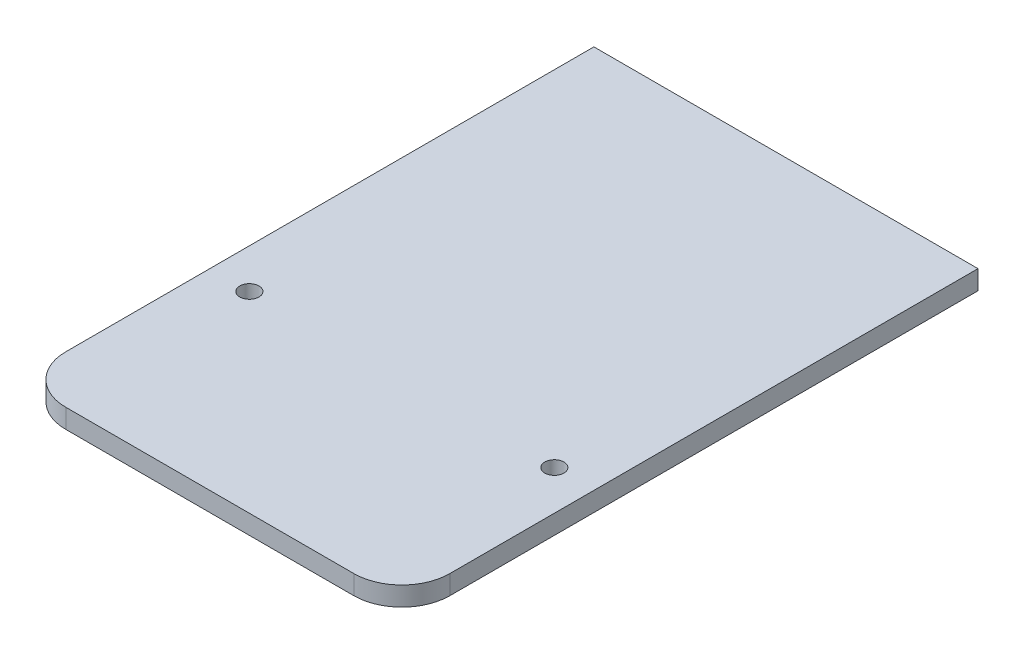
ISO-10303-21;
HEADER;
FILE_DESCRIPTION(('STEP AP214'),'2;1');
FILE_NAME('part.step','',(''),(''),'','','');
FILE_SCHEMA(('AUTOMOTIVE_DESIGN { 1 0 10303 214 1 1 1 1 }'));
ENDSEC;
DATA;
#1=APPLICATION_CONTEXT('core data for automotive mechanical design processes');
#2=APPLICATION_PROTOCOL_DEFINITION('international standard','automotive_design',2000,#1);
#3=PRODUCT_CONTEXT('',#1,'mechanical');
#4=PRODUCT('Part','Part','',(#3));
#5=PRODUCT_RELATED_PRODUCT_CATEGORY('part','',(#4));
#6=PRODUCT_DEFINITION_FORMATION('','',#4);
#7=PRODUCT_DEFINITION_CONTEXT('part definition',#1,'design');
#8=PRODUCT_DEFINITION('design','',#6,#7);
#9=PRODUCT_DEFINITION_SHAPE('','',#8);
#10=(LENGTH_UNIT() NAMED_UNIT(*) SI_UNIT(.MILLI.,.METRE.));
#11=(NAMED_UNIT(*) PLANE_ANGLE_UNIT() SI_UNIT($,.RADIAN.));
#12=(NAMED_UNIT(*) SI_UNIT($,.STERADIAN.) SOLID_ANGLE_UNIT());
#13=UNCERTAINTY_MEASURE_WITH_UNIT(LENGTH_MEASURE(1.E-05),#10,'distance_accuracy_value','');
#14=(GEOMETRIC_REPRESENTATION_CONTEXT(3) GLOBAL_UNCERTAINTY_ASSIGNED_CONTEXT((#13)) GLOBAL_UNIT_ASSIGNED_CONTEXT((#10,
#11,#12)) REPRESENTATION_CONTEXT('',''));
#15=CARTESIAN_POINT('',(0.,0.,0.));
#16=DIRECTION('',(0.,0.,1.));
#17=DIRECTION('',(1.,0.,0.));
#18=AXIS2_PLACEMENT_3D('',#15,#16,#17);
#19=CARTESIAN_POINT('',(-100.,-10.,-150.));
#20=DIRECTION('',(-1.,0.,0.));
#21=DIRECTION('',(0.,0.,1.));
#22=AXIS2_PLACEMENT_3D('',#19,#20,#21);
#23=PLANE('',#22);
#24=DIRECTION('',(0.,0.,1.));
#25=VECTOR('',#24,1.);
#26=CARTESIAN_POINT('',(-100.,0.,-150.));
#27=LINE('',#26,#25);
#28=CARTESIAN_POINT('',(-100.,0.,-150.));
#29=VERTEX_POINT('',#28);
#30=CARTESIAN_POINT('',(-100.,0.,125.));
#31=VERTEX_POINT('',#30);
#32=EDGE_CURVE('E136',#29,#31,#27,.T.);
#33=ORIENTED_EDGE('',*,*,#32,.F.);
#34=DIRECTION('',(0.,1.,0.));
#35=VECTOR('',#34,1.);
#36=CARTESIAN_POINT('',(-100.,-10.,-150.));
#37=LINE('',#36,#35);
#38=CARTESIAN_POINT('',(-100.,-10.,-150.));
#39=VERTEX_POINT('',#38);
#40=EDGE_CURVE('E11',#39,#29,#37,.T.);
#41=ORIENTED_EDGE('',*,*,#40,.F.);
#42=DIRECTION('',(0.,0.,1.));
#43=VECTOR('',#42,1.);
#44=CARTESIAN_POINT('',(-100.,-10.,-150.));
#45=LINE('',#44,#43);
#46=CARTESIAN_POINT('',(-100.,-10.,125.));
#47=VERTEX_POINT('',#46);
#48=EDGE_CURVE('E157',#39,#47,#45,.T.);
#49=ORIENTED_EDGE('',*,*,#48,.T.);
#50=DIRECTION('',(0.,1.,0.));
#51=VECTOR('',#50,1.);
#52=CARTESIAN_POINT('',(-100.,-10.,125.));
#53=LINE('',#52,#51);
#54=EDGE_CURVE('E48',#47,#31,#53,.T.);
#55=ORIENTED_EDGE('',*,*,#54,.T.);
#56=EDGE_LOOP('',(#33,#41,#49,#55));
#57=FACE_BOUND('',#56,.T.);
#58=ADVANCED_FACE('F45',(#57),#23,.T.);
#59=CARTESIAN_POINT('',(-100.,-10.,-150.));
#60=DIRECTION('',(0.,0.,-1.));
#61=DIRECTION('',(-1.,0.,0.));
#62=AXIS2_PLACEMENT_3D('',#59,#60,#61);
#63=PLANE('',#62);
#64=DIRECTION('',(-1.,0.,0.));
#65=VECTOR('',#64,1.);
#66=CARTESIAN_POINT('',(-100.,0.,-150.));
#67=LINE('',#66,#65);
#68=CARTESIAN_POINT('',(100.,0.,-150.));
#69=VERTEX_POINT('',#68);
#70=EDGE_CURVE('E154',#69,#29,#67,.T.);
#71=ORIENTED_EDGE('',*,*,#70,.F.);
#72=DIRECTION('',(0.,1.,0.));
#73=VECTOR('',#72,1.);
#74=CARTESIAN_POINT('',(100.,-10.,-150.));
#75=LINE('',#74,#73);
#76=CARTESIAN_POINT('',(100.,-10.,-150.));
#77=VERTEX_POINT('',#76);
#78=EDGE_CURVE('E55',#77,#69,#75,.T.);
#79=ORIENTED_EDGE('',*,*,#78,.F.);
#80=DIRECTION('',(-1.,0.,0.));
#81=VECTOR('',#80,1.);
#82=CARTESIAN_POINT('',(-100.,-10.,-150.));
#83=LINE('',#82,#81);
#84=EDGE_CURVE('E122',#77,#39,#83,.T.);
#85=ORIENTED_EDGE('',*,*,#84,.T.);
#86=ORIENTED_EDGE('',*,*,#40,.T.);
#87=EDGE_LOOP('',(#71,#79,#85,#86));
#88=FACE_BOUND('',#87,.T.);
#89=ADVANCED_FACE('F169',(#88),#63,.T.);
#90=CARTESIAN_POINT('',(100.,-10.,-150.));
#91=DIRECTION('',(1.,0.,0.));
#92=DIRECTION('',(0.,0.,-1.));
#93=AXIS2_PLACEMENT_3D('',#90,#91,#92);
#94=PLANE('',#93);
#95=DIRECTION('',(0.,0.,-1.));
#96=VECTOR('',#95,1.);
#97=CARTESIAN_POINT('',(100.,0.,-150.));
#98=LINE('',#97,#96);
#99=CARTESIAN_POINT('',(100.,0.,125.));
#100=VERTEX_POINT('',#99);
#101=EDGE_CURVE('E108',#100,#69,#98,.T.);
#102=ORIENTED_EDGE('',*,*,#101,.F.);
#103=DIRECTION('',(0.,1.,0.));
#104=VECTOR('',#103,1.);
#105=CARTESIAN_POINT('',(100.,-10.,125.));
#106=LINE('',#105,#104);
#107=CARTESIAN_POINT('',(100.,-10.,125.));
#108=VERTEX_POINT('',#107);
#109=EDGE_CURVE('E103',#108,#100,#106,.T.);
#110=ORIENTED_EDGE('',*,*,#109,.F.);
#111=DIRECTION('',(0.,0.,-1.));
#112=VECTOR('',#111,1.);
#113=CARTESIAN_POINT('',(100.,-10.,-150.));
#114=LINE('',#113,#112);
#115=EDGE_CURVE('E106',#108,#77,#114,.T.);
#116=ORIENTED_EDGE('',*,*,#115,.T.);
#117=ORIENTED_EDGE('',*,*,#78,.T.);
#118=EDGE_LOOP('',(#102,#110,#116,#117));
#119=FACE_BOUND('',#118,.T.);
#120=ADVANCED_FACE('F105',(#119),#94,.T.);
#121=CARTESIAN_POINT('',(75.,-10.,125.));
#122=DIRECTION('',(0.,1.,0.));
#123=DIRECTION('',(0.,0.,1.));
#124=AXIS2_PLACEMENT_3D('',#121,#122,#123);
#125=CYLINDRICAL_SURFACE('',#124,25.);
#126=CARTESIAN_POINT('',(75.,0.,125.));
#127=DIRECTION('',(0.,1.,0.));
#128=DIRECTION('',(0.,0.,1.));
#129=AXIS2_PLACEMENT_3D('',#126,#127,#128);
#130=CIRCLE('',#129,25.);
#131=CARTESIAN_POINT('',(75.,0.,150.));
#132=VERTEX_POINT('',#131);
#133=EDGE_CURVE('E149',#132,#100,#130,.T.);
#134=ORIENTED_EDGE('',*,*,#133,.F.);
#135=DIRECTION('',(0.,1.,0.));
#136=VECTOR('',#135,1.);
#137=CARTESIAN_POINT('',(75.,-10.,150.));
#138=LINE('',#137,#136);
#139=CARTESIAN_POINT('',(75.,-10.,150.));
#140=VERTEX_POINT('',#139);
#141=EDGE_CURVE('E114',#140,#132,#138,.T.);
#142=ORIENTED_EDGE('',*,*,#141,.F.);
#143=CARTESIAN_POINT('',(75.,-10.,125.));
#144=DIRECTION('',(0.,1.,0.));
#145=DIRECTION('',(0.,0.,1.));
#146=AXIS2_PLACEMENT_3D('',#143,#144,#145);
#147=CIRCLE('',#146,25.);
#148=EDGE_CURVE('E120',#140,#108,#147,.T.);
#149=ORIENTED_EDGE('',*,*,#148,.T.);
#150=ORIENTED_EDGE('',*,*,#109,.T.);
#151=EDGE_LOOP('',(#134,#142,#149,#150));
#152=FACE_BOUND('',#151,.T.);
#153=ADVANCED_FACE('F125',(#152),#125,.T.);
#154=CARTESIAN_POINT('',(-75.,-10.,150.));
#155=DIRECTION('',(0.,0.,1.));
#156=DIRECTION('',(1.,0.,0.));
#157=AXIS2_PLACEMENT_3D('',#154,#155,#156);
#158=PLANE('',#157);
#159=DIRECTION('',(1.,0.,0.));
#160=VECTOR('',#159,1.);
#161=CARTESIAN_POINT('',(-75.,0.,150.));
#162=LINE('',#161,#160);
#163=CARTESIAN_POINT('',(-75.,0.,150.));
#164=VERTEX_POINT('',#163);
#165=EDGE_CURVE('E145',#164,#132,#162,.T.);
#166=ORIENTED_EDGE('',*,*,#165,.F.);
#167=DIRECTION('',(0.,1.,0.));
#168=VECTOR('',#167,1.);
#169=CARTESIAN_POINT('',(-75.,-10.,150.));
#170=LINE('',#169,#168);
#171=CARTESIAN_POINT('',(-75.,-10.,150.));
#172=VERTEX_POINT('',#171);
#173=EDGE_CURVE('E162',#172,#164,#170,.T.);
#174=ORIENTED_EDGE('',*,*,#173,.F.);
#175=DIRECTION('',(1.,0.,0.));
#176=VECTOR('',#175,1.);
#177=CARTESIAN_POINT('',(-75.,-10.,150.));
#178=LINE('',#177,#176);
#179=EDGE_CURVE('E127',#172,#140,#178,.T.);
#180=ORIENTED_EDGE('',*,*,#179,.T.);
#181=ORIENTED_EDGE('',*,*,#141,.T.);
#182=EDGE_LOOP('',(#166,#174,#180,#181));
#183=FACE_BOUND('',#182,.T.);
#184=ADVANCED_FACE('F182',(#183),#158,.T.);
#185=CARTESIAN_POINT('',(-75.,-10.,125.));
#186=DIRECTION('',(0.,1.,0.));
#187=DIRECTION('',(0.,0.,1.));
#188=AXIS2_PLACEMENT_3D('',#185,#186,#187);
#189=CYLINDRICAL_SURFACE('',#188,25.);
#190=CARTESIAN_POINT('',(-75.,0.,125.));
#191=DIRECTION('',(0.,1.,0.));
#192=DIRECTION('',(0.,0.,1.));
#193=AXIS2_PLACEMENT_3D('',#190,#191,#192);
#194=CIRCLE('',#193,25.);
#195=EDGE_CURVE('E140',#31,#164,#194,.T.);
#196=ORIENTED_EDGE('',*,*,#195,.F.);
#197=ORIENTED_EDGE('',*,*,#54,.F.);
#198=CARTESIAN_POINT('',(-75.,-10.,125.));
#199=DIRECTION('',(0.,1.,0.));
#200=DIRECTION('',(0.,0.,1.));
#201=AXIS2_PLACEMENT_3D('',#198,#199,#200);
#202=CIRCLE('',#201,25.);
#203=EDGE_CURVE('E130',#47,#172,#202,.T.);
#204=ORIENTED_EDGE('',*,*,#203,.T.);
#205=ORIENTED_EDGE('',*,*,#173,.T.);
#206=EDGE_LOOP('',(#196,#197,#204,#205));
#207=FACE_BOUND('',#206,.T.);
#208=ADVANCED_FACE('F166',(#207),#189,.T.);
#209=CARTESIAN_POINT('',(-75.,-10.,125.));
#210=DIRECTION('',(0.,1.,0.));
#211=DIRECTION('',(0.,0.,1.));
#212=AXIS2_PLACEMENT_3D('',#209,#210,#211);
#213=PLANE('',#212);
#214=CARTESIAN_POINT('',(-79.4,-10.,50.));
#215=DIRECTION('',(0.,1.,0.));
#216=DIRECTION('',(0.,0.,1.));
#217=AXIS2_PLACEMENT_3D('',#214,#215,#216);
#218=CIRCLE('',#217,5.00000000000001);
#219=CARTESIAN_POINT('',(-79.4,-10.,55.));
#220=VERTEX_POINT('',#219);
#221=EDGE_CURVE('E141',#220,#220,#218,.T.);
#222=ORIENTED_EDGE('',*,*,#221,.T.);
#223=EDGE_LOOP('',(#222));
#224=FACE_BOUND('',#223,.T.);
#225=CARTESIAN_POINT('',(79.4,-10.,50.));
#226=DIRECTION('',(0.,1.,0.));
#227=DIRECTION('',(0.,0.,1.));
#228=AXIS2_PLACEMENT_3D('',#225,#226,#227);
#229=CIRCLE('',#228,5.00000000000001);
#230=CARTESIAN_POINT('',(79.4,-10.,55.));
#231=VERTEX_POINT('',#230);
#232=EDGE_CURVE('E218',#231,#231,#229,.T.);
#233=ORIENTED_EDGE('',*,*,#232,.T.);
#234=EDGE_LOOP('',(#233));
#235=FACE_BOUND('',#234,.T.);
#236=ORIENTED_EDGE('',*,*,#48,.F.);
#237=ORIENTED_EDGE('',*,*,#84,.F.);
#238=ORIENTED_EDGE('',*,*,#115,.F.);
#239=ORIENTED_EDGE('',*,*,#148,.F.);
#240=ORIENTED_EDGE('',*,*,#179,.F.);
#241=ORIENTED_EDGE('',*,*,#203,.F.);
#242=EDGE_LOOP('',(#236,#237,#238,#239,#240,#241));
#243=FACE_BOUND('',#242,.T.);
#244=ADVANCED_FACE('F118',(#224,#235,#243),#213,.F.);
#245=CARTESIAN_POINT('',(-75.,0.,125.));
#246=DIRECTION('',(0.,1.,0.));
#247=DIRECTION('',(0.,0.,1.));
#248=AXIS2_PLACEMENT_3D('',#245,#246,#247);
#249=PLANE('',#248);
#250=CARTESIAN_POINT('',(-79.4,0.,50.));
#251=DIRECTION('',(0.,1.,0.));
#252=DIRECTION('',(0.,0.,1.));
#253=AXIS2_PLACEMENT_3D('',#250,#251,#252);
#254=CIRCLE('',#253,5.00000000000001);
#255=CARTESIAN_POINT('',(-79.4,0.,55.));
#256=VERTEX_POINT('',#255);
#257=EDGE_CURVE('E210',#256,#256,#254,.T.);
#258=ORIENTED_EDGE('',*,*,#257,.F.);
#259=EDGE_LOOP('',(#258));
#260=FACE_BOUND('',#259,.T.);
#261=CARTESIAN_POINT('',(79.4,0.,50.));
#262=DIRECTION('',(0.,1.,0.));
#263=DIRECTION('',(0.,0.,1.));
#264=AXIS2_PLACEMENT_3D('',#261,#262,#263);
#265=CIRCLE('',#264,5.00000000000001);
#266=CARTESIAN_POINT('',(79.4,0.,55.));
#267=VERTEX_POINT('',#266);
#268=EDGE_CURVE('E212',#267,#267,#265,.T.);
#269=ORIENTED_EDGE('',*,*,#268,.F.);
#270=EDGE_LOOP('',(#269));
#271=FACE_BOUND('',#270,.T.);
#272=ORIENTED_EDGE('',*,*,#32,.T.);
#273=ORIENTED_EDGE('',*,*,#195,.T.);
#274=ORIENTED_EDGE('',*,*,#165,.T.);
#275=ORIENTED_EDGE('',*,*,#133,.T.);
#276=ORIENTED_EDGE('',*,*,#101,.T.);
#277=ORIENTED_EDGE('',*,*,#70,.T.);
#278=EDGE_LOOP('',(#272,#273,#274,#275,#276,#277));
#279=FACE_BOUND('',#278,.T.);
#280=ADVANCED_FACE('F168',(#260,#271,#279),#249,.T.);
#281=CARTESIAN_POINT('',(79.4,-10.,50.));
#282=DIRECTION('',(0.,1.,0.));
#283=DIRECTION('',(0.,0.,1.));
#284=AXIS2_PLACEMENT_3D('',#281,#282,#283);
#285=CYLINDRICAL_SURFACE('',#284,5.00000000000001);
#286=ORIENTED_EDGE('',*,*,#232,.F.);
#287=EDGE_LOOP('',(#286));
#288=FACE_BOUND('',#287,.T.);
#289=ORIENTED_EDGE('',*,*,#268,.T.);
#290=EDGE_LOOP('',(#289));
#291=FACE_BOUND('',#290,.T.);
#292=ADVANCED_FACE('F193',(#288,#291),#285,.F.);
#293=CARTESIAN_POINT('',(-79.4,-10.,50.));
#294=DIRECTION('',(0.,1.,0.));
#295=DIRECTION('',(0.,0.,1.));
#296=AXIS2_PLACEMENT_3D('',#293,#294,#295);
#297=CYLINDRICAL_SURFACE('',#296,5.00000000000001);
#298=ORIENTED_EDGE('',*,*,#221,.F.);
#299=EDGE_LOOP('',(#298));
#300=FACE_BOUND('',#299,.T.);
#301=ORIENTED_EDGE('',*,*,#257,.T.);
#302=EDGE_LOOP('',(#301));
#303=FACE_BOUND('',#302,.T.);
#304=ADVANCED_FACE('F200',(#300,#303),#297,.F.);
#305=CLOSED_SHELL('',(#58,#89,#120,#153,#184,#208,#244,#280,#292,#304));
#306=MANIFOLD_SOLID_BREP('B2',#305);
#307=ADVANCED_BREP_SHAPE_REPRESENTATION('',(#18,#306),#14);
#308=SHAPE_DEFINITION_REPRESENTATION(#9,#307);
ENDSEC;
END-ISO-10303-21;
